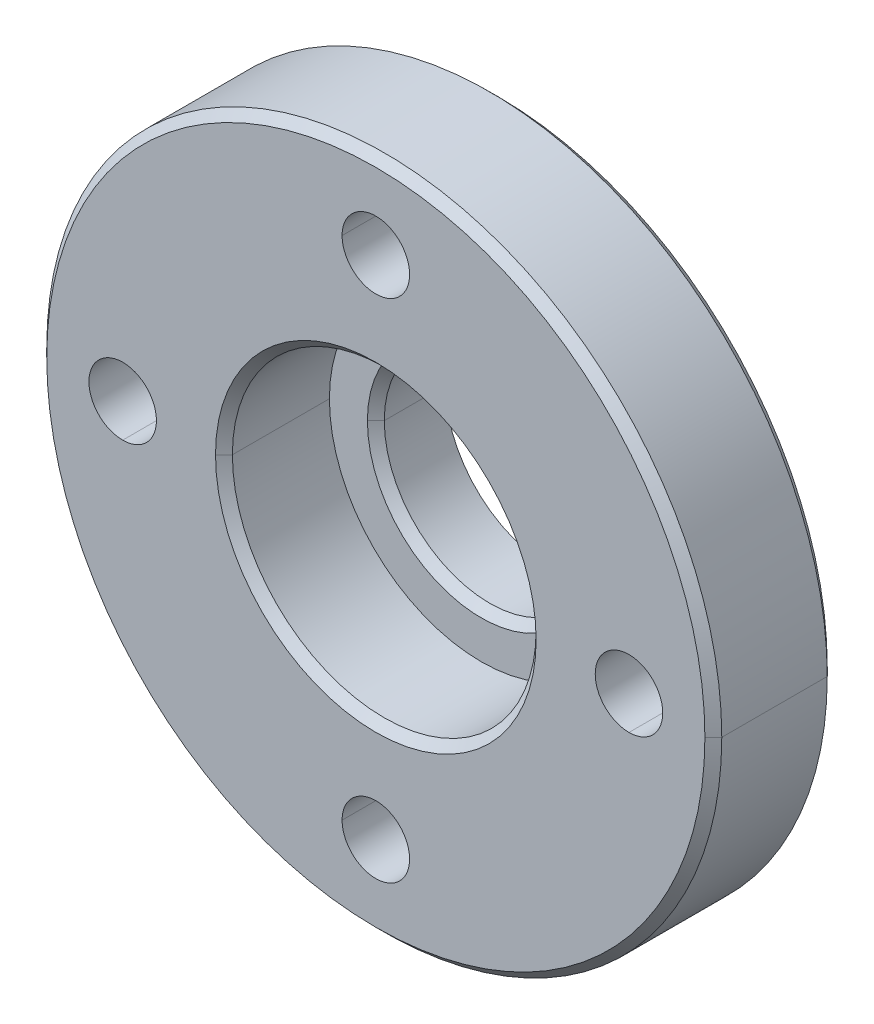
ISO-10303-21;
HEADER;
FILE_DESCRIPTION(('STEP AP214'),'2;1');
FILE_NAME('part.step','',(''),(''),'','','');
FILE_SCHEMA(('AUTOMOTIVE_DESIGN { 1 0 10303 214 1 1 1 1 }'));
ENDSEC;
DATA;
#1=APPLICATION_CONTEXT('core data for automotive mechanical design processes');
#2=APPLICATION_PROTOCOL_DEFINITION('international standard','automotive_design',2000,#1);
#3=PRODUCT_CONTEXT('',#1,'mechanical');
#4=PRODUCT('Part','Part','',(#3));
#5=PRODUCT_RELATED_PRODUCT_CATEGORY('part','',(#4));
#6=PRODUCT_DEFINITION_FORMATION('','',#4);
#7=PRODUCT_DEFINITION_CONTEXT('part definition',#1,'design');
#8=PRODUCT_DEFINITION('design','',#6,#7);
#9=PRODUCT_DEFINITION_SHAPE('','',#8);
#10=(LENGTH_UNIT() NAMED_UNIT(*) SI_UNIT(.MILLI.,.METRE.));
#11=(NAMED_UNIT(*) PLANE_ANGLE_UNIT() SI_UNIT($,.RADIAN.));
#12=(NAMED_UNIT(*) SI_UNIT($,.STERADIAN.) SOLID_ANGLE_UNIT());
#13=UNCERTAINTY_MEASURE_WITH_UNIT(LENGTH_MEASURE(1.E-05),#10,'distance_accuracy_value','');
#14=(GEOMETRIC_REPRESENTATION_CONTEXT(3) GLOBAL_UNCERTAINTY_ASSIGNED_CONTEXT((#13)) GLOBAL_UNIT_ASSIGNED_CONTEXT((#10,
#11,#12)) REPRESENTATION_CONTEXT('',''));
#15=CARTESIAN_POINT('',(0.,0.,0.));
#16=DIRECTION('',(0.,0.,1.));
#17=DIRECTION('',(1.,0.,0.));
#18=AXIS2_PLACEMENT_3D('',#15,#16,#17);
#19=CARTESIAN_POINT('',(0.,0.,0.));
#20=DIRECTION('',(0.,0.,-1.));
#21=DIRECTION('',(-1.,0.,0.));
#22=AXIS2_PLACEMENT_3D('',#19,#20,#21);
#23=CYLINDRICAL_SURFACE('',#22,3.25);
#24=DIRECTION('',(0.,-1.696913065404E-13,-1.));
#25=VECTOR('',#24,1.);
#26=CARTESIAN_POINT('',(-3.25,1.608087310036E-13,-0.3));
#27=LINE('',#26,#25);
#28=CARTESIAN_POINT('',(-3.25,0.,-0.3));
#29=VERTEX_POINT('',#28);
#30=CARTESIAN_POINT('',(-3.25,0.,-1.25));
#31=VERTEX_POINT('',#30);
#32=EDGE_CURVE('E288',#29,#31,#27,.T.);
#33=ORIENTED_EDGE('',*,*,#32,.T.);
#34=CARTESIAN_POINT('',(0.,0.,-1.25));
#35=DIRECTION('',(0.,0.,-1.));
#36=DIRECTION('',(1.,0.,0.));
#37=AXIS2_PLACEMENT_3D('',#34,#35,#36);
#38=CIRCLE('',#37,3.25);
#39=CARTESIAN_POINT('',(3.25,0.,-1.25));
#40=VERTEX_POINT('',#39);
#41=EDGE_CURVE('E254',#40,#31,#38,.T.);
#42=ORIENTED_EDGE('',*,*,#41,.F.);
#43=DIRECTION('',(0.,1.699311718979E-13,-1.));
#44=VECTOR('',#43,1.);
#45=CARTESIAN_POINT('',(3.25,-1.610366030933E-13,-0.3));
#46=LINE('',#45,#44);
#47=CARTESIAN_POINT('',(3.25,0.,-0.3));
#48=VERTEX_POINT('',#47);
#49=EDGE_CURVE('E421',#48,#40,#46,.T.);
#50=ORIENTED_EDGE('',*,*,#49,.F.);
#51=CARTESIAN_POINT('',(0.,0.,-0.3));
#52=DIRECTION('',(0.,0.,-1.));
#53=DIRECTION('',(1.,0.,0.));
#54=AXIS2_PLACEMENT_3D('',#51,#52,#53);
#55=CIRCLE('',#54,3.25);
#56=EDGE_CURVE('E11',#48,#29,#55,.T.);
#57=ORIENTED_EDGE('',*,*,#56,.T.);
#58=EDGE_LOOP('',(#33,#42,#50,#57));
#59=FACE_BOUND('',#58,.T.);
#60=ADVANCED_FACE('F17',(#59),#23,.T.);
#61=CARTESIAN_POINT('',(0.,0.,-0.3));
#62=DIRECTION('',(0.,0.,-1.));
#63=DIRECTION('',(0.999940770988799,0.01088368110184,0.));
#64=AXIS2_PLACEMENT_3D('',#61,#62,#63);
#65=TOROIDAL_SURFACE('',#64,3.55,0.3);
#66=CARTESIAN_POINT('',(-3.55,-1.067215760209E-12,-0.3));
#67=DIRECTION('',(-3.006241089398E-13,1.,0.));
#68=DIRECTION('',(0.,0.,1.));
#69=AXIS2_PLACEMENT_3D('',#66,#67,#68);
#70=CIRCLE('',#69,0.3);
#71=CARTESIAN_POINT('',(-3.55,0.,0.));
#72=VERTEX_POINT('',#71);
#73=EDGE_CURVE('E28',#72,#29,#70,.T.);
#74=ORIENTED_EDGE('',*,*,#73,.T.);
#75=ORIENTED_EDGE('',*,*,#56,.F.);
#76=CARTESIAN_POINT('',(3.55,1.067652910525E-12,-0.3));
#77=DIRECTION('',(3.007472743066E-13,-1.,0.));
#78=DIRECTION('',(0.,0.,1.));
#79=AXIS2_PLACEMENT_3D('',#76,#77,#78);
#80=CIRCLE('',#79,0.3);
#81=CARTESIAN_POINT('',(3.55,0.,0.));
#82=VERTEX_POINT('',#81);
#83=EDGE_CURVE('E287',#82,#48,#80,.T.);
#84=ORIENTED_EDGE('',*,*,#83,.F.);
#85=CARTESIAN_POINT('',(0.,0.,0.));
#86=DIRECTION('',(0.,0.,-1.));
#87=DIRECTION('',(1.,0.,0.));
#88=AXIS2_PLACEMENT_3D('',#85,#86,#87);
#89=CIRCLE('',#88,3.55);
#90=EDGE_CURVE('E357',#82,#72,#89,.T.);
#91=ORIENTED_EDGE('',*,*,#90,.T.);
#92=EDGE_LOOP('',(#74,#75,#84,#91));
#93=FACE_BOUND('',#92,.T.);
#94=ADVANCED_FACE('F498',(#93),#65,.F.);
#95=CARTESIAN_POINT('',(0.,0.,-0.3));
#96=DIRECTION('',(0.,0.,-1.));
#97=DIRECTION('',(-0.999940770988799,-0.01088368110184,0.));
#98=AXIS2_PLACEMENT_3D('',#95,#96,#97);
#99=TOROIDAL_SURFACE('',#98,3.55,0.3);
#100=ORIENTED_EDGE('',*,*,#83,.T.);
#101=CARTESIAN_POINT('',(0.,0.,-0.3));
#102=DIRECTION('',(0.,0.,-1.));
#103=DIRECTION('',(-1.,0.,0.));
#104=AXIS2_PLACEMENT_3D('',#101,#102,#103);
#105=CIRCLE('',#104,3.25);
#106=EDGE_CURVE('E284',#29,#48,#105,.T.);
#107=ORIENTED_EDGE('',*,*,#106,.F.);
#108=ORIENTED_EDGE('',*,*,#73,.F.);
#109=CARTESIAN_POINT('',(0.,0.,0.));
#110=DIRECTION('',(0.,0.,-1.));
#111=DIRECTION('',(-1.,0.,0.));
#112=AXIS2_PLACEMENT_3D('',#109,#110,#111);
#113=CIRCLE('',#112,3.55);
#114=EDGE_CURVE('E384',#72,#82,#113,.T.);
#115=ORIENTED_EDGE('',*,*,#114,.T.);
#116=EDGE_LOOP('',(#100,#107,#108,#115));
#117=FACE_BOUND('',#116,.T.);
#118=ADVANCED_FACE('F503',(#117),#99,.F.);
#119=CARTESIAN_POINT('',(0.,0.,0.));
#120=DIRECTION('',(0.,0.,-1.));
#121=DIRECTION('',(-1.,0.,0.));
#122=AXIS2_PLACEMENT_3D('',#119,#120,#121);
#123=CYLINDRICAL_SURFACE('',#122,3.25);
#124=ORIENTED_EDGE('',*,*,#49,.T.);
#125=CARTESIAN_POINT('',(0.,0.,-1.25));
#126=DIRECTION('',(0.,0.,-1.));
#127=DIRECTION('',(-1.,0.,0.));
#128=AXIS2_PLACEMENT_3D('',#125,#126,#127);
#129=CIRCLE('',#128,3.25);
#130=EDGE_CURVE('E414',#31,#40,#129,.T.);
#131=ORIENTED_EDGE('',*,*,#130,.F.);
#132=ORIENTED_EDGE('',*,*,#32,.F.);
#133=ORIENTED_EDGE('',*,*,#106,.T.);
#134=EDGE_LOOP('',(#124,#131,#132,#133));
#135=FACE_BOUND('',#134,.T.);
#136=ADVANCED_FACE('F508',(#135),#123,.T.);
#137=CARTESIAN_POINT('',(0.,0.,-1.25));
#138=DIRECTION('',(0.,0.,-1.));
#139=DIRECTION('',(0.,-1.,0.));
#140=AXIS2_PLACEMENT_3D('',#137,#138,#139);
#141=PLANE('',#140);
#142=CARTESIAN_POINT('',(0.,0.,-1.25));
#143=DIRECTION('',(0.,0.,1.));
#144=DIRECTION('',(1.,0.,0.));
#145=AXIS2_PLACEMENT_3D('',#142,#143,#144);
#146=CIRCLE('',#145,2.5);
#147=CARTESIAN_POINT('',(2.5,0.,-1.25));
#148=VERTEX_POINT('',#147);
#149=CARTESIAN_POINT('',(-2.5,0.,-1.25));
#150=VERTEX_POINT('',#149);
#151=EDGE_CURVE('E246',#148,#150,#146,.T.);
#152=ORIENTED_EDGE('',*,*,#151,.T.);
#153=CARTESIAN_POINT('',(0.,0.,-1.25));
#154=DIRECTION('',(0.,0.,1.));
#155=DIRECTION('',(-1.,0.,0.));
#156=AXIS2_PLACEMENT_3D('',#153,#154,#155);
#157=CIRCLE('',#156,2.5);
#158=EDGE_CURVE('E263',#150,#148,#157,.T.);
#159=ORIENTED_EDGE('',*,*,#158,.T.);
#160=EDGE_LOOP('',(#152,#159));
#161=FACE_BOUND('',#160,.T.);
#162=ORIENTED_EDGE('',*,*,#41,.T.);
#163=ORIENTED_EDGE('',*,*,#130,.T.);
#164=EDGE_LOOP('',(#162,#163));
#165=FACE_BOUND('',#164,.T.);
#166=ADVANCED_FACE('F511',(#161,#165),#141,.T.);
#167=CARTESIAN_POINT('',(0.,0.,0.2999999997628));
#168=DIRECTION('',(0.,0.,1.));
#169=DIRECTION('',(0.,-1.,0.));
#170=AXIS2_PLACEMENT_3D('',#167,#168,#169);
#171=CONICAL_SURFACE('',#170,2.599999999763,0.7853981633973);
#172=DIRECTION('',(0.707106781186548,-7.05345802130647E-10,0.707106781186548));
#173=VECTOR('',#172,1.);
#174=CARTESIAN_POINT('',(2.499999999778,-4.534141410797E-10,0.1999999997785));
#175=LINE('',#174,#173);
#176=CARTESIAN_POINT('',(2.5,0.,0.2));
#177=VERTEX_POINT('',#176);
#178=CARTESIAN_POINT('',(2.7,0.,0.4));
#179=VERTEX_POINT('',#178);
#180=EDGE_CURVE('E122',#177,#179,#175,.T.);
#181=ORIENTED_EDGE('',*,*,#180,.T.);
#182=CARTESIAN_POINT('',(0.,0.,0.4));
#183=DIRECTION('',(0.,0.,1.));
#184=DIRECTION('',(1.,0.,0.));
#185=AXIS2_PLACEMENT_3D('',#182,#183,#184);
#186=CIRCLE('',#185,2.7);
#187=CARTESIAN_POINT('',(-2.7,0.,0.4));
#188=VERTEX_POINT('',#187);
#189=EDGE_CURVE('E282',#179,#188,#186,.T.);
#190=ORIENTED_EDGE('',*,*,#189,.T.);
#191=DIRECTION('',(-0.707106781186548,7.05346376756247E-10,0.707106781186548));
#192=VECTOR('',#191,1.);
#193=CARTESIAN_POINT('',(-2.499999999778,4.534135268236E-10,0.1999999997785));
#194=LINE('',#193,#192);
#195=CARTESIAN_POINT('',(-2.5,0.,0.2));
#196=VERTEX_POINT('',#195);
#197=EDGE_CURVE('E108',#196,#188,#194,.T.);
#198=ORIENTED_EDGE('',*,*,#197,.F.);
#199=CARTESIAN_POINT('',(0.,0.,0.2));
#200=DIRECTION('',(0.,0.,1.));
#201=DIRECTION('',(1.,0.,0.));
#202=AXIS2_PLACEMENT_3D('',#199,#200,#201);
#203=CIRCLE('',#202,2.5);
#204=EDGE_CURVE('E250',#177,#196,#203,.T.);
#205=ORIENTED_EDGE('',*,*,#204,.F.);
#206=EDGE_LOOP('',(#181,#190,#198,#205));
#207=FACE_BOUND('',#206,.T.);
#208=ADVANCED_FACE('F251',(#207),#171,.F.);
#209=CARTESIAN_POINT('',(0.,0.,2.9));
#210=DIRECTION('',(0.,0.,1.));
#211=DIRECTION('',(1.,0.,0.));
#212=AXIS2_PLACEMENT_3D('',#209,#210,#211);
#213=CYLINDRICAL_SURFACE('',#212,2.5);
#214=DIRECTION('',(1.527835329749E-10,3.12698913682E-10,1.));
#215=VECTOR('',#214,1.);
#216=CARTESIAN_POINT('',(-2.5,0.,-1.25));
#217=LINE('',#216,#215);
#218=EDGE_CURVE('E267',#150,#196,#217,.T.);
#219=ORIENTED_EDGE('',*,*,#218,.F.);
#220=ORIENTED_EDGE('',*,*,#151,.F.);
#221=DIRECTION('',(1.527835329749E-10,3.12699337307E-10,-1.));
#222=VECTOR('',#221,1.);
#223=CARTESIAN_POINT('',(2.499999999778,-4.534141410797E-10,0.1999999997785));
#224=LINE('',#223,#222);
#225=EDGE_CURVE('E257',#177,#148,#224,.T.);
#226=ORIENTED_EDGE('',*,*,#225,.F.);
#227=ORIENTED_EDGE('',*,*,#204,.T.);
#228=EDGE_LOOP('',(#219,#220,#226,#227));
#229=FACE_BOUND('',#228,.T.);
#230=ADVANCED_FACE('F259',(#229),#213,.F.);
#231=CARTESIAN_POINT('',(0.,0.,2.9));
#232=DIRECTION('',(0.,0.,1.));
#233=DIRECTION('',(1.,0.,0.));
#234=AXIS2_PLACEMENT_3D('',#231,#232,#233);
#235=CYLINDRICAL_SURFACE('',#234,2.5);
#236=ORIENTED_EDGE('',*,*,#225,.T.);
#237=ORIENTED_EDGE('',*,*,#158,.F.);
#238=ORIENTED_EDGE('',*,*,#218,.T.);
#239=CARTESIAN_POINT('',(0.,0.,0.2));
#240=DIRECTION('',(0.,0.,1.));
#241=DIRECTION('',(-1.,0.,0.));
#242=AXIS2_PLACEMENT_3D('',#239,#240,#241);
#243=CIRCLE('',#242,2.5);
#244=EDGE_CURVE('E264',#196,#177,#243,.T.);
#245=ORIENTED_EDGE('',*,*,#244,.T.);
#246=EDGE_LOOP('',(#236,#237,#238,#245));
#247=FACE_BOUND('',#246,.T.);
#248=ADVANCED_FACE('F266',(#247),#235,.F.);
#249=CARTESIAN_POINT('',(0.,0.,0.2999999997628));
#250=DIRECTION('',(0.,0.,1.));
#251=DIRECTION('',(0.,-1.,0.));
#252=AXIS2_PLACEMENT_3D('',#249,#250,#251);
#253=CONICAL_SURFACE('',#252,2.599999999763,0.7853981633973);
#254=ORIENTED_EDGE('',*,*,#197,.T.);
#255=CARTESIAN_POINT('',(0.,0.,0.4));
#256=DIRECTION('',(0.,0.,1.));
#257=DIRECTION('',(-1.,0.,0.));
#258=AXIS2_PLACEMENT_3D('',#255,#256,#257);
#259=CIRCLE('',#258,2.7);
#260=EDGE_CURVE('E271',#188,#179,#259,.T.);
#261=ORIENTED_EDGE('',*,*,#260,.T.);
#262=ORIENTED_EDGE('',*,*,#180,.F.);
#263=ORIENTED_EDGE('',*,*,#244,.F.);
#264=EDGE_LOOP('',(#254,#261,#262,#263));
#265=FACE_BOUND('',#264,.T.);
#266=ADVANCED_FACE('F270',(#265),#253,.F.);
#267=CARTESIAN_POINT('',(0.,0.,0.4));
#268=DIRECTION('',(0.,0.,1.));
#269=DIRECTION('',(1.,0.,0.));
#270=AXIS2_PLACEMENT_3D('',#267,#268,#269);
#271=PLANE('',#270);
#272=ORIENTED_EDGE('',*,*,#189,.F.);
#273=ORIENTED_EDGE('',*,*,#260,.F.);
#274=EDGE_LOOP('',(#272,#273));
#275=FACE_BOUND('',#274,.T.);
#276=CARTESIAN_POINT('',(0.,0.,0.4));
#277=DIRECTION('',(0.,0.,1.));
#278=DIRECTION('',(-1.,0.,0.));
#279=AXIS2_PLACEMENT_3D('',#276,#277,#278);
#280=CIRCLE('',#279,3.6);
#281=CARTESIAN_POINT('',(-3.6,0.,0.4));
#282=VERTEX_POINT('',#281);
#283=CARTESIAN_POINT('',(3.6,0.,0.4));
#284=VERTEX_POINT('',#283);
#285=EDGE_CURVE('E367',#282,#284,#280,.T.);
#286=ORIENTED_EDGE('',*,*,#285,.T.);
#287=CARTESIAN_POINT('',(0.,0.,0.4));
#288=DIRECTION('',(0.,0.,1.));
#289=DIRECTION('',(1.,0.,0.));
#290=AXIS2_PLACEMENT_3D('',#287,#288,#289);
#291=CIRCLE('',#290,3.6);
#292=EDGE_CURVE('E321',#284,#282,#291,.T.);
#293=ORIENTED_EDGE('',*,*,#292,.T.);
#294=EDGE_LOOP('',(#286,#293));
#295=FACE_BOUND('',#294,.T.);
#296=ADVANCED_FACE('F19',(#275,#295),#271,.T.);
#297=CARTESIAN_POINT('',(0.,0.,2.9));
#298=DIRECTION('',(0.,0.,1.));
#299=DIRECTION('',(1.,0.,0.));
#300=AXIS2_PLACEMENT_3D('',#297,#298,#299);
#301=CYLINDRICAL_SURFACE('',#300,3.6);
#302=DIRECTION('',(5.533158472773E-11,-6.239368603533E-10,-1.));
#303=VECTOR('',#302,1.);
#304=CARTESIAN_POINT('',(3.599999999873,1.43505433786E-09,2.699999999873));
#305=LINE('',#304,#303);
#306=CARTESIAN_POINT('',(3.6,0.,2.7));
#307=VERTEX_POINT('',#306);
#308=EDGE_CURVE('E325',#307,#284,#305,.T.);
#309=ORIENTED_EDGE('',*,*,#308,.T.);
#310=ORIENTED_EDGE('',*,*,#285,.F.);
#311=DIRECTION('',(-5.533158472773E-11,6.239367308694E-10,-1.));
#312=VECTOR('',#311,1.);
#313=CARTESIAN_POINT('',(-3.599999999873,-1.435054040047E-09,2.699999999873));
#314=LINE('',#313,#312);
#315=CARTESIAN_POINT('',(-3.6,0.,2.7));
#316=VERTEX_POINT('',#315);
#317=EDGE_CURVE('E311',#316,#282,#314,.T.);
#318=ORIENTED_EDGE('',*,*,#317,.F.);
#319=CARTESIAN_POINT('',(0.,0.,2.7));
#320=DIRECTION('',(0.,0.,-1.));
#321=DIRECTION('',(1.,0.,0.));
#322=AXIS2_PLACEMENT_3D('',#319,#320,#321);
#323=CIRCLE('',#322,3.6);
#324=EDGE_CURVE('E394',#307,#316,#323,.T.);
#325=ORIENTED_EDGE('',*,*,#324,.F.);
#326=EDGE_LOOP('',(#309,#310,#318,#325));
#327=FACE_BOUND('',#326,.T.);
#328=ADVANCED_FACE('F487',(#327),#301,.F.);
#329=CARTESIAN_POINT('',(0.,0.,2.9));
#330=DIRECTION('',(0.,0.,1.));
#331=DIRECTION('',(1.,0.,0.));
#332=AXIS2_PLACEMENT_3D('',#329,#330,#331);
#333=CYLINDRICAL_SURFACE('',#332,3.6);
#334=ORIENTED_EDGE('',*,*,#317,.T.);
#335=ORIENTED_EDGE('',*,*,#292,.F.);
#336=ORIENTED_EDGE('',*,*,#308,.F.);
#337=CARTESIAN_POINT('',(0.,0.,2.7));
#338=DIRECTION('',(0.,0.,-1.));
#339=DIRECTION('',(-1.,0.,0.));
#340=AXIS2_PLACEMENT_3D('',#337,#338,#339);
#341=CIRCLE('',#340,3.6);
#342=EDGE_CURVE('E307',#316,#307,#341,.T.);
#343=ORIENTED_EDGE('',*,*,#342,.F.);
#344=EDGE_LOOP('',(#334,#335,#336,#343));
#345=FACE_BOUND('',#344,.T.);
#346=ADVANCED_FACE('F493',(#345),#333,.F.);
#347=CARTESIAN_POINT('',(0.,0.,2.799999999836));
#348=DIRECTION('',(0.,0.,1.));
#349=DIRECTION('',(0.,-1.,0.));
#350=AXIS2_PLACEMENT_3D('',#347,#348,#349);
#351=CONICAL_SURFACE('',#350,3.699999999836,0.7853981633973);
#352=DIRECTION('',(0.707106781186548,2.06705571793414E-09,-0.707106781186548));
#353=VECTOR('',#352,1.);
#354=CARTESIAN_POINT('',(-3.799999999821,-2.019705685992E-09,2.899999999821));
#355=LINE('',#354,#353);
#356=CARTESIAN_POINT('',(-3.8,0.,2.9));
#357=VERTEX_POINT('',#356);
#358=EDGE_CURVE('E224',#357,#316,#355,.T.);
#359=ORIENTED_EDGE('',*,*,#358,.T.);
#360=ORIENTED_EDGE('',*,*,#342,.T.);
#361=DIRECTION('',(-0.707106781186548,-2.06705834066114E-09,-0.707106781186548));
#362=VECTOR('',#361,1.);
#363=CARTESIAN_POINT('',(3.799999999821,2.019706725624E-09,2.899999999821));
#364=LINE('',#363,#362);
#365=CARTESIAN_POINT('',(3.8,0.,2.9));
#366=VERTEX_POINT('',#365);
#367=EDGE_CURVE('E335',#366,#307,#364,.T.);
#368=ORIENTED_EDGE('',*,*,#367,.F.);
#369=CARTESIAN_POINT('',(0.,0.,2.9));
#370=DIRECTION('',(0.,0.,-1.));
#371=DIRECTION('',(-1.,0.,0.));
#372=AXIS2_PLACEMENT_3D('',#369,#370,#371);
#373=CIRCLE('',#372,3.8);
#374=EDGE_CURVE('E406',#357,#366,#373,.T.);
#375=ORIENTED_EDGE('',*,*,#374,.F.);
#376=EDGE_LOOP('',(#359,#360,#368,#375));
#377=FACE_BOUND('',#376,.T.);
#378=ADVANCED_FACE('F538',(#377),#351,.F.);
#379=CARTESIAN_POINT('',(0.,0.,2.799999999836));
#380=DIRECTION('',(0.,0.,1.));
#381=DIRECTION('',(0.,-1.,0.));
#382=AXIS2_PLACEMENT_3D('',#379,#380,#381);
#383=CONICAL_SURFACE('',#382,3.699999999836,0.7853981633973);
#384=ORIENTED_EDGE('',*,*,#367,.T.);
#385=ORIENTED_EDGE('',*,*,#324,.T.);
#386=ORIENTED_EDGE('',*,*,#358,.F.);
#387=CARTESIAN_POINT('',(0.,0.,2.9));
#388=DIRECTION('',(0.,0.,-1.));
#389=DIRECTION('',(1.,0.,0.));
#390=AXIS2_PLACEMENT_3D('',#387,#388,#389);
#391=CIRCLE('',#390,3.8);
#392=EDGE_CURVE('E410',#366,#357,#391,.T.);
#393=ORIENTED_EDGE('',*,*,#392,.F.);
#394=EDGE_LOOP('',(#384,#385,#386,#393));
#395=FACE_BOUND('',#394,.T.);
#396=ADVANCED_FACE('F541',(#395),#383,.F.);
#397=CARTESIAN_POINT('',(0.,0.,0.));
#398=DIRECTION('',(0.,0.,1.));
#399=DIRECTION('',(1.,0.,0.));
#400=AXIS2_PLACEMENT_3D('',#397,#398,#399);
#401=CYLINDRICAL_SURFACE('',#400,8.);
#402=DIRECTION('',(0.,0.,1.));
#403=VECTOR('',#402,1.);
#404=CARTESIAN_POINT('',(7.99999999998,8.556401381127E-10,0.1999999999803));
#405=LINE('',#404,#403);
#406=CARTESIAN_POINT('',(7.99999999998,8.556401381127E-10,0.1999999999803));
#407=VERTEX_POINT('',#406);
#408=CARTESIAN_POINT('',(8.,0.,2.7));
#409=VERTEX_POINT('',#408);
#410=EDGE_CURVE('E339',#407,#409,#405,.T.);
#411=ORIENTED_EDGE('',*,*,#410,.F.);
#412=CARTESIAN_POINT('',(0.,0.,0.2));
#413=DIRECTION('',(0.,0.,-1.));
#414=DIRECTION('',(-1.,0.,0.));
#415=AXIS2_PLACEMENT_3D('',#412,#413,#414);
#416=CIRCLE('',#415,8.);
#417=CARTESIAN_POINT('',(-7.99999999998,-8.55640374388E-10,0.1999999999803));
#418=VERTEX_POINT('',#417);
#419=EDGE_CURVE('E383',#418,#407,#416,.T.);
#420=ORIENTED_EDGE('',*,*,#419,.F.);
#421=DIRECTION('',(0.,0.,1.));
#422=VECTOR('',#421,1.);
#423=CARTESIAN_POINT('',(-7.99999999998,-8.55640374388E-10,0.1999999999803));
#424=LINE('',#423,#422);
#425=CARTESIAN_POINT('',(-8.,0.,2.7));
#426=VERTEX_POINT('',#425);
#427=EDGE_CURVE('E305',#418,#426,#424,.T.);
#428=ORIENTED_EDGE('',*,*,#427,.T.);
#429=CARTESIAN_POINT('',(0.,0.,2.7));
#430=DIRECTION('',(0.,0.,1.));
#431=DIRECTION('',(1.,0.,0.));
#432=AXIS2_PLACEMENT_3D('',#429,#430,#431);
#433=CIRCLE('',#432,8.);
#434=EDGE_CURVE('E320',#409,#426,#433,.T.);
#435=ORIENTED_EDGE('',*,*,#434,.F.);
#436=EDGE_LOOP('',(#411,#420,#428,#435));
#437=FACE_BOUND('',#436,.T.);
#438=ADVANCED_FACE('F546',(#437),#401,.T.);
#439=CARTESIAN_POINT('',(0.,0.,2.800000000025));
#440=DIRECTION('',(0.,0.,-1.));
#441=DIRECTION('',(0.,-1.,0.));
#442=AXIS2_PLACEMENT_3D('',#439,#440,#441);
#443=CONICAL_SURFACE('',#442,7.899999999975,0.7853981633973);
#444=DIRECTION('',(0.707106781186548,-9.07547447789361E-10,-0.707106781186548));
#445=VECTOR('',#444,1.);
#446=CARTESIAN_POINT('',(7.799999999974,1.112332875863E-09,2.900000000026));
#447=LINE('',#446,#445);
#448=CARTESIAN_POINT('',(7.8,0.,2.9));
#449=VERTEX_POINT('',#448);
#450=EDGE_CURVE('E289',#449,#409,#447,.T.);
#451=ORIENTED_EDGE('',*,*,#450,.T.);
#452=ORIENTED_EDGE('',*,*,#434,.T.);
#453=DIRECTION('',(-0.707106781186548,9.07549632804761E-10,-0.707106781186548));
#454=VECTOR('',#453,1.);
#455=CARTESIAN_POINT('',(-7.799999999974,-1.1123359506E-09,2.900000000026));
#456=LINE('',#455,#454);
#457=CARTESIAN_POINT('',(-7.8,0.,2.9));
#458=VERTEX_POINT('',#457);
#459=EDGE_CURVE('E294',#458,#426,#456,.T.);
#460=ORIENTED_EDGE('',*,*,#459,.F.);
#461=CARTESIAN_POINT('',(0.,0.,2.9));
#462=DIRECTION('',(0.,0.,1.));
#463=DIRECTION('',(1.,0.,0.));
#464=AXIS2_PLACEMENT_3D('',#461,#462,#463);
#465=CIRCLE('',#464,7.8);
#466=EDGE_CURVE('E388',#449,#458,#465,.T.);
#467=ORIENTED_EDGE('',*,*,#466,.F.);
#468=EDGE_LOOP('',(#451,#452,#460,#467));
#469=FACE_BOUND('',#468,.T.);
#470=ADVANCED_FACE('F543',(#469),#443,.T.);
#471=CARTESIAN_POINT('',(6.,0.,2.9));
#472=DIRECTION('',(0.,0.,1.));
#473=DIRECTION('',(0.,-1.,0.));
#474=AXIS2_PLACEMENT_3D('',#471,#472,#473);
#475=CYLINDRICAL_SURFACE('',#474,0.8);
#476=CARTESIAN_POINT('',(6.,0.,0.));
#477=DIRECTION('',(0.,0.,1.));
#478=DIRECTION('',(0.,1.,0.));
#479=AXIS2_PLACEMENT_3D('',#476,#477,#478);
#480=CIRCLE('',#479,0.8);
#481=CARTESIAN_POINT('',(6.,0.8,0.));
#482=VERTEX_POINT('',#481);
#483=CARTESIAN_POINT('',(6.,-0.8,0.));
#484=VERTEX_POINT('',#483);
#485=EDGE_CURVE('E299',#482,#484,#480,.T.);
#486=ORIENTED_EDGE('',*,*,#485,.F.);
#487=DIRECTION('',(0.,0.,-1.));
#488=VECTOR('',#487,1.);
#489=CARTESIAN_POINT('',(6.,0.8,2.9));
#490=LINE('',#489,#488);
#491=CARTESIAN_POINT('',(6.,0.8,2.9));
#492=VERTEX_POINT('',#491);
#493=EDGE_CURVE('E70',#492,#482,#490,.T.);
#494=ORIENTED_EDGE('',*,*,#493,.F.);
#495=CARTESIAN_POINT('',(6.,0.,2.9));
#496=DIRECTION('',(0.,0.,1.));
#497=DIRECTION('',(0.,1.,0.));
#498=AXIS2_PLACEMENT_3D('',#495,#496,#497);
#499=CIRCLE('',#498,0.8);
#500=CARTESIAN_POINT('',(6.,-0.8,2.9));
#501=VERTEX_POINT('',#500);
#502=EDGE_CURVE('E370',#492,#501,#499,.T.);
#503=ORIENTED_EDGE('',*,*,#502,.T.);
#504=DIRECTION('',(0.,0.,-1.));
#505=VECTOR('',#504,1.);
#506=CARTESIAN_POINT('',(6.,-0.8,2.9));
#507=LINE('',#506,#505);
#508=EDGE_CURVE('E317',#501,#484,#507,.T.);
#509=ORIENTED_EDGE('',*,*,#508,.T.);
#510=EDGE_LOOP('',(#486,#494,#503,#509));
#511=FACE_BOUND('',#510,.T.);
#512=ADVANCED_FACE('F529',(#511),#475,.F.);
#513=CARTESIAN_POINT('',(6.,0.,2.9));
#514=DIRECTION('',(0.,0.,1.));
#515=DIRECTION('',(0.,-1.,0.));
#516=AXIS2_PLACEMENT_3D('',#513,#514,#515);
#517=CYLINDRICAL_SURFACE('',#516,0.8);
#518=CARTESIAN_POINT('',(6.,0.,2.9));
#519=DIRECTION('',(0.,0.,1.));
#520=DIRECTION('',(0.,-1.,0.));
#521=AXIS2_PLACEMENT_3D('',#518,#519,#520);
#522=CIRCLE('',#521,0.8);
#523=EDGE_CURVE('E332',#501,#492,#522,.T.);
#524=ORIENTED_EDGE('',*,*,#523,.T.);
#525=ORIENTED_EDGE('',*,*,#493,.T.);
#526=CARTESIAN_POINT('',(6.,0.,0.));
#527=DIRECTION('',(0.,0.,1.));
#528=DIRECTION('',(0.,-1.,0.));
#529=AXIS2_PLACEMENT_3D('',#526,#527,#528);
#530=CIRCLE('',#529,0.8);
#531=EDGE_CURVE('E354',#484,#482,#530,.T.);
#532=ORIENTED_EDGE('',*,*,#531,.F.);
#533=ORIENTED_EDGE('',*,*,#508,.F.);
#534=EDGE_LOOP('',(#524,#525,#532,#533));
#535=FACE_BOUND('',#534,.T.);
#536=ADVANCED_FACE('F525',(#535),#517,.F.);
#537=CARTESIAN_POINT('',(0.,-6.,2.9));
#538=DIRECTION('',(0.,0.,1.));
#539=DIRECTION('',(-1.,0.,0.));
#540=AXIS2_PLACEMENT_3D('',#537,#538,#539);
#541=CYLINDRICAL_SURFACE('',#540,0.8);
#542=CARTESIAN_POINT('',(0.,-6.,0.));
#543=DIRECTION('',(0.,0.,1.));
#544=DIRECTION('',(1.,0.,0.));
#545=AXIS2_PLACEMENT_3D('',#542,#543,#544);
#546=CIRCLE('',#545,0.8);
#547=CARTESIAN_POINT('',(0.8,-6.,0.));
#548=VERTEX_POINT('',#547);
#549=CARTESIAN_POINT('',(-0.8,-6.,0.));
#550=VERTEX_POINT('',#549);
#551=EDGE_CURVE('E300',#548,#550,#546,.T.);
#552=ORIENTED_EDGE('',*,*,#551,.F.);
#553=DIRECTION('',(0.,0.,-1.));
#554=VECTOR('',#553,1.);
#555=CARTESIAN_POINT('',(0.8,-6.,2.9));
#556=LINE('',#555,#554);
#557=CARTESIAN_POINT('',(0.8,-6.,2.9));
#558=VERTEX_POINT('',#557);
#559=EDGE_CURVE('E167',#558,#548,#556,.T.);
#560=ORIENTED_EDGE('',*,*,#559,.F.);
#561=CARTESIAN_POINT('',(0.,-6.,2.9));
#562=DIRECTION('',(0.,0.,1.));
#563=DIRECTION('',(1.,0.,0.));
#564=AXIS2_PLACEMENT_3D('',#561,#562,#563);
#565=CIRCLE('',#564,0.8);
#566=CARTESIAN_POINT('',(-0.8,-6.,2.9));
#567=VERTEX_POINT('',#566);
#568=EDGE_CURVE('E312',#558,#567,#565,.T.);
#569=ORIENTED_EDGE('',*,*,#568,.T.);
#570=DIRECTION('',(0.,0.,-1.));
#571=VECTOR('',#570,1.);
#572=CARTESIAN_POINT('',(-0.8,-6.,2.9));
#573=LINE('',#572,#571);
#574=EDGE_CURVE('E87',#567,#550,#573,.T.);
#575=ORIENTED_EDGE('',*,*,#574,.T.);
#576=EDGE_LOOP('',(#552,#560,#569,#575));
#577=FACE_BOUND('',#576,.T.);
#578=ADVANCED_FACE('F528',(#577),#541,.F.);
#579=CARTESIAN_POINT('',(0.,-6.,2.9));
#580=DIRECTION('',(0.,0.,1.));
#581=DIRECTION('',(-1.,0.,0.));
#582=AXIS2_PLACEMENT_3D('',#579,#580,#581);
#583=CYLINDRICAL_SURFACE('',#582,0.8);
#584=CARTESIAN_POINT('',(0.,-6.,2.9));
#585=DIRECTION('',(0.,0.,1.));
#586=DIRECTION('',(-1.,0.,0.));
#587=AXIS2_PLACEMENT_3D('',#584,#585,#586);
#588=CIRCLE('',#587,0.8);
#589=EDGE_CURVE('E315',#567,#558,#588,.T.);
#590=ORIENTED_EDGE('',*,*,#589,.T.);
#591=ORIENTED_EDGE('',*,*,#559,.T.);
#592=CARTESIAN_POINT('',(0.,-6.,0.));
#593=DIRECTION('',(0.,0.,1.));
#594=DIRECTION('',(-1.,0.,0.));
#595=AXIS2_PLACEMENT_3D('',#592,#593,#594);
#596=CIRCLE('',#595,0.8);
#597=EDGE_CURVE('E295',#550,#548,#596,.T.);
#598=ORIENTED_EDGE('',*,*,#597,.F.);
#599=ORIENTED_EDGE('',*,*,#574,.F.);
#600=EDGE_LOOP('',(#590,#591,#598,#599));
#601=FACE_BOUND('',#600,.T.);
#602=ADVANCED_FACE('F523',(#601),#583,.F.);
#603=CARTESIAN_POINT('',(-6.,0.,2.9));
#604=DIRECTION('',(0.,0.,1.));
#605=DIRECTION('',(0.,1.,0.));
#606=AXIS2_PLACEMENT_3D('',#603,#604,#605);
#607=CYLINDRICAL_SURFACE('',#606,0.8);
#608=CARTESIAN_POINT('',(-6.,0.,0.));
#609=DIRECTION('',(0.,0.,1.));
#610=DIRECTION('',(0.,-1.,0.));
#611=AXIS2_PLACEMENT_3D('',#608,#609,#610);
#612=CIRCLE('',#611,0.8);
#613=CARTESIAN_POINT('',(-6.,-0.8,0.));
#614=VERTEX_POINT('',#613);
#615=CARTESIAN_POINT('',(-6.,0.8,0.));
#616=VERTEX_POINT('',#615);
#617=EDGE_CURVE('E362',#614,#616,#612,.T.);
#618=ORIENTED_EDGE('',*,*,#617,.F.);
#619=DIRECTION('',(0.,0.,-1.));
#620=VECTOR('',#619,1.);
#621=CARTESIAN_POINT('',(-6.,-0.8,2.9));
#622=LINE('',#621,#620);
#623=CARTESIAN_POINT('',(-6.,-0.8,2.9));
#624=VERTEX_POINT('',#623);
#625=EDGE_CURVE('E328',#624,#614,#622,.T.);
#626=ORIENTED_EDGE('',*,*,#625,.F.);
#627=CARTESIAN_POINT('',(-6.,0.,2.9));
#628=DIRECTION('',(0.,0.,1.));
#629=DIRECTION('',(0.,-1.,0.));
#630=AXIS2_PLACEMENT_3D('',#627,#628,#629);
#631=CIRCLE('',#630,0.8);
#632=CARTESIAN_POINT('',(-6.,0.8,2.9));
#633=VERTEX_POINT('',#632);
#634=EDGE_CURVE('E350',#624,#633,#631,.T.);
#635=ORIENTED_EDGE('',*,*,#634,.T.);
#636=DIRECTION('',(0.,0.,-1.));
#637=VECTOR('',#636,1.);
#638=CARTESIAN_POINT('',(-6.,0.8,2.9));
#639=LINE('',#638,#637);
#640=EDGE_CURVE('E181',#633,#616,#639,.T.);
#641=ORIENTED_EDGE('',*,*,#640,.T.);
#642=EDGE_LOOP('',(#618,#626,#635,#641));
#643=FACE_BOUND('',#642,.T.);
#644=ADVANCED_FACE('F519',(#643),#607,.F.);
#645=CARTESIAN_POINT('',(-6.,0.,2.9));
#646=DIRECTION('',(0.,0.,1.));
#647=DIRECTION('',(0.,1.,0.));
#648=AXIS2_PLACEMENT_3D('',#645,#646,#647);
#649=CYLINDRICAL_SURFACE('',#648,0.8);
#650=CARTESIAN_POINT('',(-6.,0.,2.9));
#651=DIRECTION('',(0.,0.,1.));
#652=DIRECTION('',(0.,1.,0.));
#653=AXIS2_PLACEMENT_3D('',#650,#651,#652);
#654=CIRCLE('',#653,0.8);
#655=EDGE_CURVE('E316',#633,#624,#654,.T.);
#656=ORIENTED_EDGE('',*,*,#655,.T.);
#657=ORIENTED_EDGE('',*,*,#625,.T.);
#658=CARTESIAN_POINT('',(-6.,0.,0.));
#659=DIRECTION('',(0.,0.,1.));
#660=DIRECTION('',(0.,1.,0.));
#661=AXIS2_PLACEMENT_3D('',#658,#659,#660);
#662=CIRCLE('',#661,0.8);
#663=EDGE_CURVE('E343',#616,#614,#662,.T.);
#664=ORIENTED_EDGE('',*,*,#663,.F.);
#665=ORIENTED_EDGE('',*,*,#640,.F.);
#666=EDGE_LOOP('',(#656,#657,#664,#665));
#667=FACE_BOUND('',#666,.T.);
#668=ADVANCED_FACE('F522',(#667),#649,.F.);
#669=CARTESIAN_POINT('',(0.,6.,2.9));
#670=DIRECTION('',(0.,0.,1.));
#671=DIRECTION('',(1.,0.,0.));
#672=AXIS2_PLACEMENT_3D('',#669,#670,#671);
#673=CYLINDRICAL_SURFACE('',#672,0.8);
#674=DIRECTION('',(0.,0.,-1.));
#675=VECTOR('',#674,1.);
#676=CARTESIAN_POINT('',(-0.8,6.,2.9));
#677=LINE('',#676,#675);
#678=CARTESIAN_POINT('',(-0.8,6.,2.9));
#679=VERTEX_POINT('',#678);
#680=CARTESIAN_POINT('',(-0.8,6.,0.));
#681=VERTEX_POINT('',#680);
#682=EDGE_CURVE('E205',#679,#681,#677,.T.);
#683=ORIENTED_EDGE('',*,*,#682,.F.);
#684=CARTESIAN_POINT('',(0.,6.,2.9));
#685=DIRECTION('',(0.,0.,1.));
#686=DIRECTION('',(-1.,0.,0.));
#687=AXIS2_PLACEMENT_3D('',#684,#685,#686);
#688=CIRCLE('',#687,0.8);
#689=CARTESIAN_POINT('',(0.8,6.,2.9));
#690=VERTEX_POINT('',#689);
#691=EDGE_CURVE('E329',#679,#690,#688,.T.);
#692=ORIENTED_EDGE('',*,*,#691,.T.);
#693=DIRECTION('',(0.,0.,-1.));
#694=VECTOR('',#693,1.);
#695=CARTESIAN_POINT('',(0.8,6.,2.9));
#696=LINE('',#695,#694);
#697=CARTESIAN_POINT('',(0.8,6.,0.));
#698=VERTEX_POINT('',#697);
#699=EDGE_CURVE('E212',#690,#698,#696,.T.);
#700=ORIENTED_EDGE('',*,*,#699,.T.);
#701=CARTESIAN_POINT('',(0.,6.,0.));
#702=DIRECTION('',(0.,0.,1.));
#703=DIRECTION('',(-1.,0.,0.));
#704=AXIS2_PLACEMENT_3D('',#701,#702,#703);
#705=CIRCLE('',#704,0.8);
#706=EDGE_CURVE('E363',#681,#698,#705,.T.);
#707=ORIENTED_EDGE('',*,*,#706,.F.);
#708=EDGE_LOOP('',(#683,#692,#700,#707));
#709=FACE_BOUND('',#708,.T.);
#710=ADVANCED_FACE('F536',(#709),#673,.F.);
#711=CARTESIAN_POINT('',(0.,6.,2.9));
#712=DIRECTION('',(0.,0.,1.));
#713=DIRECTION('',(1.,0.,0.));
#714=AXIS2_PLACEMENT_3D('',#711,#712,#713);
#715=CYLINDRICAL_SURFACE('',#714,0.8);
#716=ORIENTED_EDGE('',*,*,#699,.F.);
#717=CARTESIAN_POINT('',(0.,6.,2.9));
#718=DIRECTION('',(0.,0.,1.));
#719=DIRECTION('',(1.,0.,0.));
#720=AXIS2_PLACEMENT_3D('',#717,#718,#719);
#721=CIRCLE('',#720,0.8);
#722=EDGE_CURVE('E21',#690,#679,#721,.T.);
#723=ORIENTED_EDGE('',*,*,#722,.T.);
#724=ORIENTED_EDGE('',*,*,#682,.T.);
#725=CARTESIAN_POINT('',(0.,6.,0.));
#726=DIRECTION('',(0.,0.,1.));
#727=DIRECTION('',(1.,0.,0.));
#728=AXIS2_PLACEMENT_3D('',#725,#726,#727);
#729=CIRCLE('',#728,0.8);
#730=EDGE_CURVE('E358',#698,#681,#729,.T.);
#731=ORIENTED_EDGE('',*,*,#730,.F.);
#732=EDGE_LOOP('',(#716,#723,#724,#731));
#733=FACE_BOUND('',#732,.T.);
#734=ADVANCED_FACE('F534',(#733),#715,.F.);
#735=CARTESIAN_POINT('',(0.,0.,2.9));
#736=DIRECTION('',(0.,0.,1.));
#737=DIRECTION('',(1.,0.,0.));
#738=AXIS2_PLACEMENT_3D('',#735,#736,#737);
#739=PLANE('',#738);
#740=ORIENTED_EDGE('',*,*,#374,.T.);
#741=ORIENTED_EDGE('',*,*,#392,.T.);
#742=EDGE_LOOP('',(#740,#741));
#743=FACE_BOUND('',#742,.T.);
#744=ORIENTED_EDGE('',*,*,#691,.F.);
#745=ORIENTED_EDGE('',*,*,#722,.F.);
#746=EDGE_LOOP('',(#744,#745));
#747=FACE_BOUND('',#746,.T.);
#748=ORIENTED_EDGE('',*,*,#502,.F.);
#749=ORIENTED_EDGE('',*,*,#523,.F.);
#750=EDGE_LOOP('',(#748,#749));
#751=FACE_BOUND('',#750,.T.);
#752=ORIENTED_EDGE('',*,*,#568,.F.);
#753=ORIENTED_EDGE('',*,*,#589,.F.);
#754=EDGE_LOOP('',(#752,#753));
#755=FACE_BOUND('',#754,.T.);
#756=ORIENTED_EDGE('',*,*,#634,.F.);
#757=ORIENTED_EDGE('',*,*,#655,.F.);
#758=EDGE_LOOP('',(#756,#757));
#759=FACE_BOUND('',#758,.T.);
#760=ORIENTED_EDGE('',*,*,#466,.T.);
#761=CARTESIAN_POINT('',(0.,0.,2.9));
#762=DIRECTION('',(0.,0.,1.));
#763=DIRECTION('',(-1.,0.,0.));
#764=AXIS2_PLACEMENT_3D('',#761,#762,#763);
#765=CIRCLE('',#764,7.8);
#766=EDGE_CURVE('E293',#458,#449,#765,.T.);
#767=ORIENTED_EDGE('',*,*,#766,.T.);
#768=EDGE_LOOP('',(#760,#767));
#769=FACE_BOUND('',#768,.T.);
#770=ADVANCED_FACE('F517',(#743,#747,#751,#755,#759,#769),#739,.T.);
#771=CARTESIAN_POINT('',(0.,0.,2.800000000025));
#772=DIRECTION('',(0.,0.,-1.));
#773=DIRECTION('',(0.,-1.,0.));
#774=AXIS2_PLACEMENT_3D('',#771,#772,#773);
#775=CONICAL_SURFACE('',#774,7.899999999975,0.7853981633973);
#776=ORIENTED_EDGE('',*,*,#459,.T.);
#777=CARTESIAN_POINT('',(0.,0.,2.7));
#778=DIRECTION('',(0.,0.,1.));
#779=DIRECTION('',(-1.,0.,0.));
#780=AXIS2_PLACEMENT_3D('',#777,#778,#779);
#781=CIRCLE('',#780,8.);
#782=EDGE_CURVE('E347',#426,#409,#781,.T.);
#783=ORIENTED_EDGE('',*,*,#782,.T.);
#784=ORIENTED_EDGE('',*,*,#450,.F.);
#785=ORIENTED_EDGE('',*,*,#766,.F.);
#786=EDGE_LOOP('',(#776,#783,#784,#785));
#787=FACE_BOUND('',#786,.T.);
#788=ADVANCED_FACE('F513',(#787),#775,.T.);
#789=CARTESIAN_POINT('',(0.,0.,0.));
#790=DIRECTION('',(0.,0.,1.));
#791=DIRECTION('',(1.,0.,0.));
#792=AXIS2_PLACEMENT_3D('',#789,#790,#791);
#793=CYLINDRICAL_SURFACE('',#792,8.);
#794=ORIENTED_EDGE('',*,*,#427,.F.);
#795=CARTESIAN_POINT('',(0.,0.,0.2));
#796=DIRECTION('',(0.,0.,-1.));
#797=DIRECTION('',(1.,0.,0.));
#798=AXIS2_PLACEMENT_3D('',#795,#796,#797);
#799=CIRCLE('',#798,8.);
#800=EDGE_CURVE('E301',#407,#418,#799,.T.);
#801=ORIENTED_EDGE('',*,*,#800,.F.);
#802=ORIENTED_EDGE('',*,*,#410,.T.);
#803=ORIENTED_EDGE('',*,*,#782,.F.);
#804=EDGE_LOOP('',(#794,#801,#802,#803));
#805=FACE_BOUND('',#804,.T.);
#806=ADVANCED_FACE('F516',(#805),#793,.T.);
#807=CARTESIAN_POINT('',(0.,0.,0.09999999997483));
#808=DIRECTION('',(0.,0.,1.));
#809=DIRECTION('',(0.,-1.,0.));
#810=AXIS2_PLACEMENT_3D('',#807,#808,#809);
#811=CONICAL_SURFACE('',#810,7.899999999975,0.7853981633973);
#812=DIRECTION('',(0.707106781186548,-9.07552001057461E-10,0.707106781186548));
#813=VECTOR('',#812,1.);
#814=CARTESIAN_POINT('',(7.799999999974,1.112334607811E-09,-2.559878235312E-11));
#815=LINE('',#814,#813);
#816=CARTESIAN_POINT('',(7.8,0.,0.));
#817=VERTEX_POINT('',#816);
#818=EDGE_CURVE('E306',#817,#407,#815,.T.);
#819=ORIENTED_EDGE('',*,*,#818,.T.);
#820=ORIENTED_EDGE('',*,*,#800,.T.);
#821=DIRECTION('',(-0.707106781186548,9.07545707573661E-10,0.707106781186548));
#822=VECTOR('',#821,1.);
#823=CARTESIAN_POINT('',(-7.799999999974,-1.11233306402E-09,-2.559878235312E-11));
#824=LINE('',#823,#822);
#825=CARTESIAN_POINT('',(-7.8,0.,0.));
#826=VERTEX_POINT('',#825);
#827=EDGE_CURVE('E379',#826,#418,#824,.T.);
#828=ORIENTED_EDGE('',*,*,#827,.F.);
#829=CARTESIAN_POINT('',(0.,0.,0.));
#830=DIRECTION('',(0.,0.,-1.));
#831=DIRECTION('',(1.,0.,0.));
#832=AXIS2_PLACEMENT_3D('',#829,#830,#831);
#833=CIRCLE('',#832,7.8);
#834=EDGE_CURVE('E374',#817,#826,#833,.T.);
#835=ORIENTED_EDGE('',*,*,#834,.F.);
#836=EDGE_LOOP('',(#819,#820,#828,#835));
#837=FACE_BOUND('',#836,.T.);
#838=ADVANCED_FACE('F570',(#837),#811,.T.);
#839=CARTESIAN_POINT('',(0.,0.,0.09999999997482));
#840=DIRECTION('',(0.,0.,1.));
#841=DIRECTION('',(0.,-1.,0.));
#842=AXIS2_PLACEMENT_3D('',#839,#840,#841);
#843=CONICAL_SURFACE('',#842,7.899999999975,0.7853981633973);
#844=ORIENTED_EDGE('',*,*,#827,.T.);
#845=ORIENTED_EDGE('',*,*,#419,.T.);
#846=ORIENTED_EDGE('',*,*,#818,.F.);
#847=CARTESIAN_POINT('',(0.,0.,0.));
#848=DIRECTION('',(0.,0.,-1.));
#849=DIRECTION('',(-1.,0.,0.));
#850=AXIS2_PLACEMENT_3D('',#847,#848,#849);
#851=CIRCLE('',#850,7.8);
#852=EDGE_CURVE('E378',#826,#817,#851,.T.);
#853=ORIENTED_EDGE('',*,*,#852,.F.);
#854=EDGE_LOOP('',(#844,#845,#846,#853));
#855=FACE_BOUND('',#854,.T.);
#856=ADVANCED_FACE('F551',(#855),#843,.T.);
#857=CARTESIAN_POINT('',(0.,0.,0.));
#858=DIRECTION('',(0.,0.,1.));
#859=DIRECTION('',(1.,0.,0.));
#860=AXIS2_PLACEMENT_3D('',#857,#858,#859);
#861=PLANE('',#860);
#862=ORIENTED_EDGE('',*,*,#90,.F.);
#863=ORIENTED_EDGE('',*,*,#114,.F.);
#864=EDGE_LOOP('',(#862,#863));
#865=FACE_BOUND('',#864,.T.);
#866=ORIENTED_EDGE('',*,*,#485,.T.);
#867=ORIENTED_EDGE('',*,*,#531,.T.);
#868=EDGE_LOOP('',(#866,#867));
#869=FACE_BOUND('',#868,.T.);
#870=ORIENTED_EDGE('',*,*,#551,.T.);
#871=ORIENTED_EDGE('',*,*,#597,.T.);
#872=EDGE_LOOP('',(#870,#871));
#873=FACE_BOUND('',#872,.T.);
#874=ORIENTED_EDGE('',*,*,#617,.T.);
#875=ORIENTED_EDGE('',*,*,#663,.T.);
#876=EDGE_LOOP('',(#874,#875));
#877=FACE_BOUND('',#876,.T.);
#878=ORIENTED_EDGE('',*,*,#706,.T.);
#879=ORIENTED_EDGE('',*,*,#730,.T.);
#880=EDGE_LOOP('',(#878,#879));
#881=FACE_BOUND('',#880,.T.);
#882=ORIENTED_EDGE('',*,*,#834,.T.);
#883=ORIENTED_EDGE('',*,*,#852,.T.);
#884=EDGE_LOOP('',(#882,#883));
#885=FACE_BOUND('',#884,.T.);
#886=ADVANCED_FACE('F548',(#865,#869,#873,#877,#881,#885),#861,.F.);
#887=CLOSED_SHELL('',(#60,#94,#118,#136,#166,#208,#230,#248,#266,#296,#328,#346,#378,#396,#438,
#470,#512,#536,#578,#602,#644,#668,#710,#734,#770,#788,#806,#838,#856,#886));
#888=MANIFOLD_SOLID_BREP('B1',#887);
#889=ADVANCED_BREP_SHAPE_REPRESENTATION('',(#18,#888),#14);
#890=SHAPE_DEFINITION_REPRESENTATION(#9,#889);
ENDSEC;
END-ISO-10303-21;
